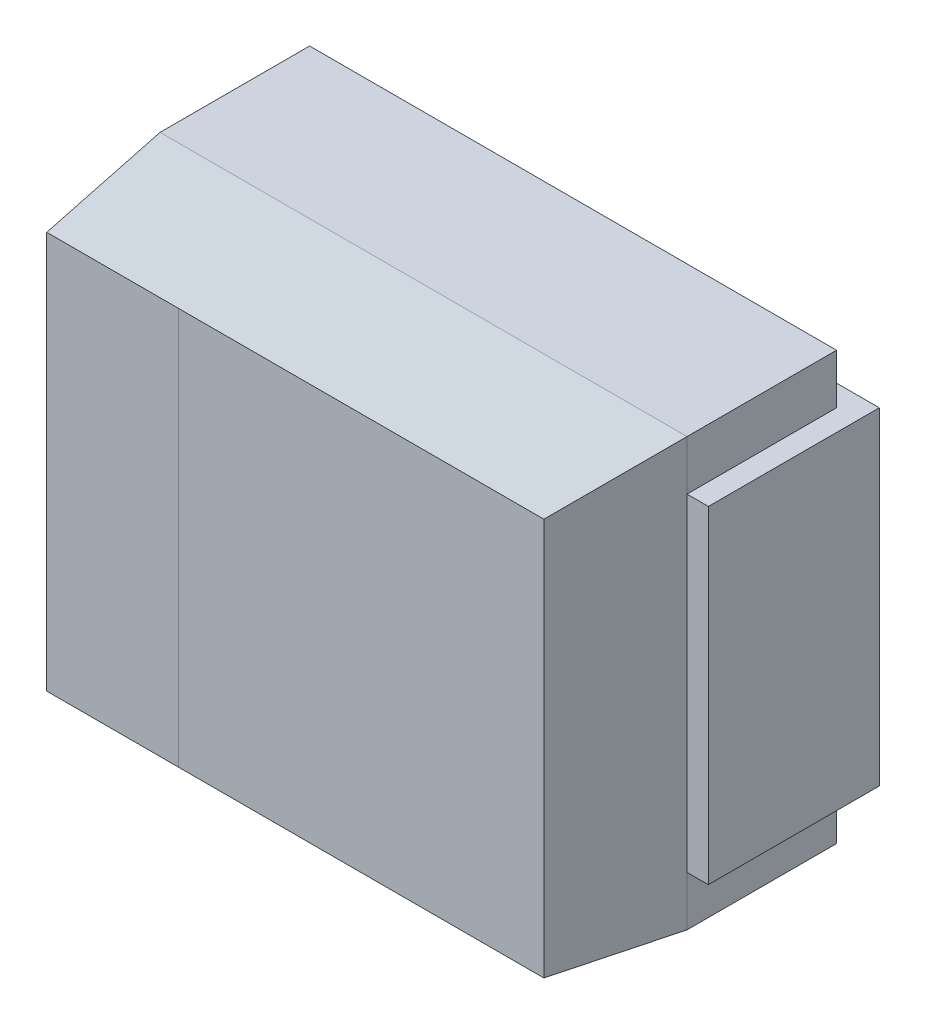
ISO-10303-21;
HEADER;
FILE_DESCRIPTION(('STEP AP214'),'2;1');
FILE_NAME('part.step','',(''),(''),'','','');
FILE_SCHEMA(('AUTOMOTIVE_DESIGN { 1 0 10303 214 1 1 1 1 }'));
ENDSEC;
DATA;
#1=APPLICATION_CONTEXT('core data for automotive mechanical design processes');
#2=APPLICATION_PROTOCOL_DEFINITION('international standard','automotive_design',2000,#1);
#3=PRODUCT_CONTEXT('',#1,'mechanical');
#4=PRODUCT('Part','Part','',(#3));
#5=PRODUCT_RELATED_PRODUCT_CATEGORY('part','',(#4));
#6=PRODUCT_DEFINITION_FORMATION('','',#4);
#7=PRODUCT_DEFINITION_CONTEXT('part definition',#1,'design');
#8=PRODUCT_DEFINITION('design','',#6,#7);
#9=PRODUCT_DEFINITION_SHAPE('','',#8);
#10=(LENGTH_UNIT() NAMED_UNIT(*) SI_UNIT(.MILLI.,.METRE.));
#11=(NAMED_UNIT(*) PLANE_ANGLE_UNIT() SI_UNIT($,.RADIAN.));
#12=(NAMED_UNIT(*) SI_UNIT($,.STERADIAN.) SOLID_ANGLE_UNIT());
#13=UNCERTAINTY_MEASURE_WITH_UNIT(LENGTH_MEASURE(1.E-05),#10,'distance_accuracy_value','');
#14=(GEOMETRIC_REPRESENTATION_CONTEXT(3) GLOBAL_UNCERTAINTY_ASSIGNED_CONTEXT((#13)) GLOBAL_UNIT_ASSIGNED_CONTEXT((#10,
#11,#12)) REPRESENTATION_CONTEXT('',''));
#15=CARTESIAN_POINT('',(0.,0.,0.));
#16=DIRECTION('',(0.,0.,1.));
#17=DIRECTION('',(1.,0.,0.));
#18=AXIS2_PLACEMENT_3D('',#15,#16,#17);
#19=CARTESIAN_POINT('',(-2.001,-1.151,0.));
#20=DIRECTION('',(0.,0.,-1.));
#21=DIRECTION('',(0.,1.,0.));
#22=AXIS2_PLACEMENT_3D('',#19,#20,#21);
#23=PLANE('',#22);
#24=DIRECTION('',(0.,1.,0.));
#25=VECTOR('',#24,1.);
#26=CARTESIAN_POINT('',(-0.9,0.,0.));
#27=LINE('',#26,#25);
#28=CARTESIAN_POINT('',(-0.9,-1.15,0.));
#29=VERTEX_POINT('',#28);
#30=CARTESIAN_POINT('',(-0.9,1.15,0.));
#31=VERTEX_POINT('',#30);
#32=EDGE_CURVE('E318',#29,#31,#27,.T.);
#33=ORIENTED_EDGE('',*,*,#32,.F.);
#34=DIRECTION('',(1.,0.,0.));
#35=VECTOR('',#34,1.);
#36=CARTESIAN_POINT('',(-1.45,-1.15,0.));
#37=LINE('',#36,#35);
#38=CARTESIAN_POINT('',(-2.,-1.15,0.));
#39=VERTEX_POINT('',#38);
#40=EDGE_CURVE('E319',#39,#29,#37,.T.);
#41=ORIENTED_EDGE('',*,*,#40,.F.);
#42=DIRECTION('',(0.,-1.,0.));
#43=VECTOR('',#42,1.);
#44=CARTESIAN_POINT('',(-2.,0.,0.));
#45=LINE('',#44,#43);
#46=CARTESIAN_POINT('',(-2.,1.15,0.));
#47=VERTEX_POINT('',#46);
#48=EDGE_CURVE('E322',#47,#39,#45,.T.);
#49=ORIENTED_EDGE('',*,*,#48,.F.);
#50=DIRECTION('',(1.,0.,0.));
#51=VECTOR('',#50,1.);
#52=CARTESIAN_POINT('',(-1.45,1.15,0.));
#53=LINE('',#52,#51);
#54=EDGE_CURVE('E325',#47,#31,#53,.T.);
#55=ORIENTED_EDGE('',*,*,#54,.T.);
#56=EDGE_LOOP('',(#33,#41,#49,#55));
#57=FACE_BOUND('',#56,.T.);
#58=ADVANCED_FACE('F16',(#57),#23,.T.);
#59=CARTESIAN_POINT('',(-2.,1.151,-0.001));
#60=DIRECTION('',(-1.,0.,0.));
#61=DIRECTION('',(0.,-1.,0.));
#62=AXIS2_PLACEMENT_3D('',#59,#60,#61);
#63=PLANE('',#62);
#64=DIRECTION('',(0.,-1.,0.));
#65=VECTOR('',#64,1.);
#66=CARTESIAN_POINT('',(-2.,0.,1.2));
#67=LINE('',#66,#65);
#68=CARTESIAN_POINT('',(-2.,1.15,1.2));
#69=VERTEX_POINT('',#68);
#70=CARTESIAN_POINT('',(-2.,-1.15,1.2));
#71=VERTEX_POINT('',#70);
#72=EDGE_CURVE('E278',#69,#71,#67,.T.);
#73=ORIENTED_EDGE('',*,*,#72,.F.);
#74=DIRECTION('',(0.,0.,1.));
#75=VECTOR('',#74,1.);
#76=CARTESIAN_POINT('',(-2.,1.15,0.6));
#77=LINE('',#76,#75);
#78=EDGE_CURVE('E304',#47,#69,#77,.T.);
#79=ORIENTED_EDGE('',*,*,#78,.F.);
#80=ORIENTED_EDGE('',*,*,#48,.T.);
#81=DIRECTION('',(0.,0.,-1.));
#82=VECTOR('',#81,1.);
#83=CARTESIAN_POINT('',(-2.,-1.15,0.6));
#84=LINE('',#83,#82);
#85=EDGE_CURVE('E315',#71,#39,#84,.T.);
#86=ORIENTED_EDGE('',*,*,#85,.F.);
#87=EDGE_LOOP('',(#73,#79,#80,#86));
#88=FACE_BOUND('',#87,.T.);
#89=ADVANCED_FACE('F613',(#88),#63,.T.);
#90=CARTESIAN_POINT('',(-2.001,-1.15,-0.001));
#91=DIRECTION('',(0.,-1.,0.));
#92=DIRECTION('',(1.,0.,0.));
#93=AXIS2_PLACEMENT_3D('',#90,#91,#92);
#94=PLANE('',#93);
#95=DIRECTION('',(1.,0.,0.));
#96=VECTOR('',#95,1.);
#97=CARTESIAN_POINT('',(-1.925,-1.15,1.2));
#98=LINE('',#97,#96);
#99=CARTESIAN_POINT('',(-1.85,-1.15,1.2));
#100=VERTEX_POINT('',#99);
#101=EDGE_CURVE('E275',#71,#100,#98,.T.);
#102=ORIENTED_EDGE('',*,*,#101,.F.);
#103=ORIENTED_EDGE('',*,*,#85,.T.);
#104=ORIENTED_EDGE('',*,*,#40,.T.);
#105=DIRECTION('',(0.,0.,-1.));
#106=VECTOR('',#105,1.);
#107=CARTESIAN_POINT('',(-0.9,-1.15,0.075));
#108=LINE('',#107,#106);
#109=CARTESIAN_POINT('',(-0.9,-1.15,0.15));
#110=VERTEX_POINT('',#109);
#111=EDGE_CURVE('E308',#110,#29,#108,.T.);
#112=ORIENTED_EDGE('',*,*,#111,.F.);
#113=DIRECTION('',(1.,0.,0.));
#114=VECTOR('',#113,1.);
#115=CARTESIAN_POINT('',(0.,-1.15,0.15));
#116=LINE('',#115,#114);
#117=CARTESIAN_POINT('',(-1.85,-1.15,0.15));
#118=VERTEX_POINT('',#117);
#119=EDGE_CURVE('E228',#118,#110,#116,.T.);
#120=ORIENTED_EDGE('',*,*,#119,.F.);
#121=DIRECTION('',(0.,0.,-1.));
#122=VECTOR('',#121,1.);
#123=CARTESIAN_POINT('',(-1.85,-1.15,0.675));
#124=LINE('',#123,#122);
#125=EDGE_CURVE('E266',#100,#118,#124,.T.);
#126=ORIENTED_EDGE('',*,*,#125,.F.);
#127=EDGE_LOOP('',(#102,#103,#104,#112,#120,#126));
#128=FACE_BOUND('',#127,.T.);
#129=ADVANCED_FACE('F564',(#128),#94,.T.);
#130=CARTESIAN_POINT('',(-0.9,-1.151,-0.001));
#131=DIRECTION('',(1.,0.,0.));
#132=DIRECTION('',(0.,1.,0.));
#133=AXIS2_PLACEMENT_3D('',#130,#131,#132);
#134=PLANE('',#133);
#135=DIRECTION('',(0.,1.,0.));
#136=VECTOR('',#135,1.);
#137=CARTESIAN_POINT('',(-0.9,0.,0.15));
#138=LINE('',#137,#136);
#139=CARTESIAN_POINT('',(-0.9,1.15,0.15));
#140=VERTEX_POINT('',#139);
#141=EDGE_CURVE('E224',#110,#140,#138,.T.);
#142=ORIENTED_EDGE('',*,*,#141,.F.);
#143=ORIENTED_EDGE('',*,*,#111,.T.);
#144=ORIENTED_EDGE('',*,*,#32,.T.);
#145=DIRECTION('',(0.,0.,-1.));
#146=VECTOR('',#145,1.);
#147=CARTESIAN_POINT('',(-0.9,1.15,0.6));
#148=LINE('',#147,#146);
#149=EDGE_CURVE('E307',#140,#31,#148,.T.);
#150=ORIENTED_EDGE('',*,*,#149,.F.);
#151=EDGE_LOOP('',(#142,#143,#144,#150));
#152=FACE_BOUND('',#151,.T.);
#153=ADVANCED_FACE('F616',(#152),#134,.T.);
#154=CARTESIAN_POINT('',(-0.899,1.15,-0.001));
#155=DIRECTION('',(0.,1.,0.));
#156=DIRECTION('',(-1.,0.,0.));
#157=AXIS2_PLACEMENT_3D('',#154,#155,#156);
#158=PLANE('',#157);
#159=DIRECTION('',(-1.,0.,0.));
#160=VECTOR('',#159,1.);
#161=CARTESIAN_POINT('',(0.,1.15,0.15));
#162=LINE('',#161,#160);
#163=CARTESIAN_POINT('',(-1.85,1.15,0.15));
#164=VERTEX_POINT('',#163);
#165=EDGE_CURVE('E227',#140,#164,#162,.T.);
#166=ORIENTED_EDGE('',*,*,#165,.F.);
#167=ORIENTED_EDGE('',*,*,#149,.T.);
#168=ORIENTED_EDGE('',*,*,#54,.F.);
#169=ORIENTED_EDGE('',*,*,#78,.T.);
#170=DIRECTION('',(-1.,0.,0.));
#171=VECTOR('',#170,1.);
#172=CARTESIAN_POINT('',(-1.925,1.15,1.2));
#173=LINE('',#172,#171);
#174=CARTESIAN_POINT('',(-1.85,1.15,1.2));
#175=VERTEX_POINT('',#174);
#176=EDGE_CURVE('E268',#175,#69,#173,.T.);
#177=ORIENTED_EDGE('',*,*,#176,.F.);
#178=DIRECTION('',(0.,0.,1.));
#179=VECTOR('',#178,1.);
#180=CARTESIAN_POINT('',(-1.85,1.15,0.675));
#181=LINE('',#180,#179);
#182=EDGE_CURVE('E237',#164,#175,#181,.T.);
#183=ORIENTED_EDGE('',*,*,#182,.F.);
#184=EDGE_LOOP('',(#166,#167,#168,#169,#177,#183));
#185=FACE_BOUND('',#184,.T.);
#186=ADVANCED_FACE('F609',(#185),#158,.T.);
#187=CARTESIAN_POINT('',(-2.001,1.151,1.2));
#188=DIRECTION('',(0.,0.,1.));
#189=DIRECTION('',(0.,-1.,0.));
#190=AXIS2_PLACEMENT_3D('',#187,#188,#189);
#191=PLANE('',#190);
#192=DIRECTION('',(0.,-1.,0.));
#193=VECTOR('',#192,1.);
#194=CARTESIAN_POINT('',(-1.85,0.,1.2));
#195=LINE('',#194,#193);
#196=EDGE_CURVE('E248',#175,#100,#195,.T.);
#197=ORIENTED_EDGE('',*,*,#196,.F.);
#198=ORIENTED_EDGE('',*,*,#176,.T.);
#199=ORIENTED_EDGE('',*,*,#72,.T.);
#200=ORIENTED_EDGE('',*,*,#101,.T.);
#201=EDGE_LOOP('',(#197,#198,#199,#200));
#202=FACE_BOUND('',#201,.T.);
#203=ADVANCED_FACE('F561',(#202),#191,.T.);
#204=CARTESIAN_POINT('',(-1.85,-1.149,1.201));
#205=DIRECTION('',(-1.,0.,0.));
#206=DIRECTION('',(0.,0.,-1.));
#207=AXIS2_PLACEMENT_3D('',#204,#205,#206);
#208=PLANE('',#207);
#209=DIRECTION('',(0.,0.,-1.));
#210=VECTOR('',#209,1.);
#211=CARTESIAN_POINT('',(-1.85,-1.5,0.675));
#212=LINE('',#211,#210);
#213=CARTESIAN_POINT('',(-1.85,-1.5,1.2));
#214=VERTEX_POINT('',#213);
#215=CARTESIAN_POINT('',(-1.85,-1.5,0.15));
#216=VERTEX_POINT('',#215);
#217=EDGE_CURVE('E218',#214,#216,#212,.T.);
#218=ORIENTED_EDGE('',*,*,#217,.F.);
#219=DIRECTION('',(0.,-1.,0.));
#220=VECTOR('',#219,1.);
#221=CARTESIAN_POINT('',(-1.85,0.,1.2));
#222=LINE('',#221,#220);
#223=EDGE_CURVE('E260',#100,#214,#222,.T.);
#224=ORIENTED_EDGE('',*,*,#223,.F.);
#225=ORIENTED_EDGE('',*,*,#125,.T.);
#226=DIRECTION('',(0.,1.,0.));
#227=VECTOR('',#226,1.);
#228=CARTESIAN_POINT('',(-1.85,0.,0.15));
#229=LINE('',#228,#227);
#230=EDGE_CURVE('E231',#216,#118,#229,.T.);
#231=ORIENTED_EDGE('',*,*,#230,.F.);
#232=EDGE_LOOP('',(#218,#224,#225,#231));
#233=FACE_BOUND('',#232,.T.);
#234=ADVANCED_FACE('F557',(#233),#208,.T.);
#235=CARTESIAN_POINT('',(-1.85,1.501,1.201));
#236=DIRECTION('',(-1.,0.,0.));
#237=DIRECTION('',(0.,0.,-1.));
#238=AXIS2_PLACEMENT_3D('',#235,#236,#237);
#239=PLANE('',#238);
#240=DIRECTION('',(0.,0.,1.));
#241=VECTOR('',#240,1.);
#242=CARTESIAN_POINT('',(-1.85,1.5,0.675));
#243=LINE('',#242,#241);
#244=CARTESIAN_POINT('',(-1.85,1.5,0.15));
#245=VERTEX_POINT('',#244);
#246=CARTESIAN_POINT('',(-1.85,1.5,1.2));
#247=VERTEX_POINT('',#246);
#248=EDGE_CURVE('E209',#245,#247,#243,.T.);
#249=ORIENTED_EDGE('',*,*,#248,.F.);
#250=DIRECTION('',(0.,1.,0.));
#251=VECTOR('',#250,1.);
#252=CARTESIAN_POINT('',(-1.85,0.,0.15));
#253=LINE('',#252,#251);
#254=EDGE_CURVE('E223',#164,#245,#253,.T.);
#255=ORIENTED_EDGE('',*,*,#254,.F.);
#256=ORIENTED_EDGE('',*,*,#182,.T.);
#257=DIRECTION('',(0.,-1.,0.));
#258=VECTOR('',#257,1.);
#259=CARTESIAN_POINT('',(-1.85,0.,1.2));
#260=LINE('',#259,#258);
#261=EDGE_CURVE('E222',#247,#175,#260,.T.);
#262=ORIENTED_EDGE('',*,*,#261,.F.);
#263=EDGE_LOOP('',(#249,#255,#256,#262));
#264=FACE_BOUND('',#263,.T.);
#265=ADVANCED_FACE('F606',(#264),#239,.T.);
#266=CARTESIAN_POINT('',(-1.851,-1.501,0.15));
#267=DIRECTION('',(0.,0.,-1.));
#268=DIRECTION('',(0.,1.,0.));
#269=AXIS2_PLACEMENT_3D('',#266,#267,#268);
#270=PLANE('',#269);
#271=DIRECTION('',(-1.,0.,0.));
#272=VECTOR('',#271,1.);
#273=CARTESIAN_POINT('',(0.,1.5,0.15));
#274=LINE('',#273,#272);
#275=CARTESIAN_POINT('',(1.85,1.5,0.15));
#276=VERTEX_POINT('',#275);
#277=EDGE_CURVE('E210',#276,#245,#274,.T.);
#278=ORIENTED_EDGE('',*,*,#277,.F.);
#279=DIRECTION('',(0.,-1.,0.));
#280=VECTOR('',#279,1.);
#281=CARTESIAN_POINT('',(1.85,0.,0.15));
#282=LINE('',#281,#280);
#283=CARTESIAN_POINT('',(1.85,1.15,0.15));
#284=VERTEX_POINT('',#283);
#285=EDGE_CURVE('E219',#276,#284,#282,.T.);
#286=ORIENTED_EDGE('',*,*,#285,.T.);
#287=DIRECTION('',(-1.,0.,0.));
#288=VECTOR('',#287,1.);
#289=CARTESIAN_POINT('',(0.,1.15,0.15));
#290=LINE('',#289,#288);
#291=CARTESIAN_POINT('',(0.9,1.15,0.15));
#292=VERTEX_POINT('',#291);
#293=EDGE_CURVE('E235',#284,#292,#290,.T.);
#294=ORIENTED_EDGE('',*,*,#293,.T.);
#295=DIRECTION('',(0.,1.,0.));
#296=VECTOR('',#295,1.);
#297=CARTESIAN_POINT('',(0.9,0.,0.15));
#298=LINE('',#297,#296);
#299=CARTESIAN_POINT('',(0.9,-1.15,0.15));
#300=VERTEX_POINT('',#299);
#301=EDGE_CURVE('E203',#300,#292,#298,.T.);
#302=ORIENTED_EDGE('',*,*,#301,.F.);
#303=DIRECTION('',(1.,0.,0.));
#304=VECTOR('',#303,1.);
#305=CARTESIAN_POINT('',(0.,-1.15,0.15));
#306=LINE('',#305,#304);
#307=CARTESIAN_POINT('',(1.85,-1.15,0.15));
#308=VERTEX_POINT('',#307);
#309=EDGE_CURVE('E232',#300,#308,#306,.T.);
#310=ORIENTED_EDGE('',*,*,#309,.T.);
#311=DIRECTION('',(0.,-1.,0.));
#312=VECTOR('',#311,1.);
#313=CARTESIAN_POINT('',(1.85,0.,0.15));
#314=LINE('',#313,#312);
#315=CARTESIAN_POINT('',(1.85,-1.5,0.15));
#316=VERTEX_POINT('',#315);
#317=EDGE_CURVE('E229',#308,#316,#314,.T.);
#318=ORIENTED_EDGE('',*,*,#317,.T.);
#319=DIRECTION('',(1.,0.,0.));
#320=VECTOR('',#319,1.);
#321=CARTESIAN_POINT('',(0.,-1.5,0.15));
#322=LINE('',#321,#320);
#323=EDGE_CURVE('E214',#216,#316,#322,.T.);
#324=ORIENTED_EDGE('',*,*,#323,.F.);
#325=ORIENTED_EDGE('',*,*,#230,.T.);
#326=ORIENTED_EDGE('',*,*,#119,.T.);
#327=ORIENTED_EDGE('',*,*,#141,.T.);
#328=ORIENTED_EDGE('',*,*,#165,.T.);
#329=ORIENTED_EDGE('',*,*,#254,.T.);
#330=EDGE_LOOP('',(#278,#286,#294,#302,#310,#318,#324,#325,#326,#327,#328,#329));
#331=FACE_BOUND('',#330,.T.);
#332=ADVANCED_FACE('F365',(#331),#270,.T.);
#333=CARTESIAN_POINT('',(-1.74488411930044,1.501,2.10099326313909));
#334=DIRECTION('',(-0.993263139087243,0.,0.115880699560177));
#335=DIRECTION('',(-0.115880699560177,0.,-0.993263139087243));
#336=AXIS2_PLACEMENT_3D('',#333,#334,#335);
#337=PLANE('',#336);
#338=CARTESIAN_POINT('',(-1.74476979994519,1.395,2.102));
#339=DIRECTION('',(0.,-1.,0.));
#340=VECTOR('',#339,1.);
#341=LINE('',#338,#340);
#342=CARTESIAN_POINT('',(-1.7449616333242,1.395,2.10099552388782));
#343=VERTEX_POINT('',#342);
#344=CARTESIAN_POINT('',(-1.7449232666484,-1.395,2.10099552388782));
#345=VERTEX_POINT('',#344);
#346=EDGE_CURVE('E202',#343,#345,#341,.T.);
#347=ORIENTED_EDGE('',*,*,#346,.F.);
#348=CARTESIAN_POINT('',(-1.745,1.395,2.1));
#349=DIRECTION('',(-0.115110406239669,0.11511040623967,-0.986660624911462));
#350=VECTOR('',#349,1.);
#351=LINE('',#348,#350);
#352=EDGE_CURVE('E176',#343,#247,#351,.T.);
#353=ORIENTED_EDGE('',*,*,#352,.T.);
#354=ORIENTED_EDGE('',*,*,#261,.T.);
#355=ORIENTED_EDGE('',*,*,#196,.T.);
#356=ORIENTED_EDGE('',*,*,#223,.T.);
#357=CARTESIAN_POINT('',(-1.85,-1.5,1.2));
#358=DIRECTION('',(0.115110406239669,0.115110406239671,0.986660624911462));
#359=VECTOR('',#358,1.);
#360=LINE('',#357,#359);
#361=EDGE_CURVE('E263',#214,#345,#360,.T.);
#362=ORIENTED_EDGE('',*,*,#361,.T.);
#363=EDGE_LOOP('',(#347,#353,#354,#355,#356,#362));
#364=FACE_BOUND('',#363,.T.);
#365=ADVANCED_FACE('F354',(#364),#337,.T.);
#366=CARTESIAN_POINT('',(-1.851,-1.5,1.201));
#367=DIRECTION('',(0.,-1.,0.));
#368=DIRECTION('',(0.,0.,-1.));
#369=AXIS2_PLACEMENT_3D('',#366,#367,#368);
#370=PLANE('',#369);
#371=ORIENTED_EDGE('',*,*,#323,.T.);
#372=DIRECTION('',(0.,0.,1.));
#373=VECTOR('',#372,1.);
#374=CARTESIAN_POINT('',(1.85,-1.5,0.675));
#375=LINE('',#374,#373);
#376=CARTESIAN_POINT('',(1.85,-1.5,1.2));
#377=VERTEX_POINT('',#376);
#378=EDGE_CURVE('E217',#316,#377,#375,.T.);
#379=ORIENTED_EDGE('',*,*,#378,.T.);
#380=DIRECTION('',(1.,0.,0.));
#381=VECTOR('',#380,1.);
#382=CARTESIAN_POINT('',(0.,-1.5,1.2));
#383=LINE('',#382,#381);
#384=EDGE_CURVE('E251',#214,#377,#383,.T.);
#385=ORIENTED_EDGE('',*,*,#384,.F.);
#386=ORIENTED_EDGE('',*,*,#217,.T.);
#387=EDGE_LOOP('',(#371,#379,#385,#386));
#388=FACE_BOUND('',#387,.T.);
#389=ADVANCED_FACE('F364',(#388),#370,.T.);
#390=CARTESIAN_POINT('',(-1.851,1.5,0.149));
#391=DIRECTION('',(0.,1.,0.));
#392=DIRECTION('',(0.,0.,1.));
#393=AXIS2_PLACEMENT_3D('',#390,#391,#392);
#394=PLANE('',#393);
#395=ORIENTED_EDGE('',*,*,#277,.T.);
#396=ORIENTED_EDGE('',*,*,#248,.T.);
#397=DIRECTION('',(-1.,0.,0.));
#398=VECTOR('',#397,1.);
#399=CARTESIAN_POINT('',(0.,1.5,1.2));
#400=LINE('',#399,#398);
#401=CARTESIAN_POINT('',(1.85,1.5,1.2));
#402=VERTEX_POINT('',#401);
#403=EDGE_CURVE('E238',#402,#247,#400,.T.);
#404=ORIENTED_EDGE('',*,*,#403,.F.);
#405=DIRECTION('',(0.,0.,-1.));
#406=VECTOR('',#405,1.);
#407=CARTESIAN_POINT('',(1.85,1.5,0.675));
#408=LINE('',#407,#406);
#409=EDGE_CURVE('E213',#402,#276,#408,.T.);
#410=ORIENTED_EDGE('',*,*,#409,.T.);
#411=EDGE_LOOP('',(#395,#396,#404,#410));
#412=FACE_BOUND('',#411,.T.);
#413=ADVANCED_FACE('F602',(#412),#394,.T.);
#414=CARTESIAN_POINT('',(0.9,1.151,-0.001));
#415=DIRECTION('',(-1.,0.,0.));
#416=DIRECTION('',(0.,-1.,0.));
#417=AXIS2_PLACEMENT_3D('',#414,#415,#416);
#418=PLANE('',#417);
#419=ORIENTED_EDGE('',*,*,#301,.T.);
#420=DIRECTION('',(0.,0.,-1.));
#421=VECTOR('',#420,1.);
#422=CARTESIAN_POINT('',(0.9,1.15,0.075));
#423=LINE('',#422,#421);
#424=CARTESIAN_POINT('',(0.9,1.15,0.));
#425=VERTEX_POINT('',#424);
#426=EDGE_CURVE('E200',#292,#425,#423,.T.);
#427=ORIENTED_EDGE('',*,*,#426,.T.);
#428=DIRECTION('',(0.,1.,0.));
#429=VECTOR('',#428,1.);
#430=CARTESIAN_POINT('',(0.9,0.,0.));
#431=LINE('',#430,#429);
#432=CARTESIAN_POINT('',(0.9,-1.15,0.));
#433=VERTEX_POINT('',#432);
#434=EDGE_CURVE('E585',#433,#425,#431,.T.);
#435=ORIENTED_EDGE('',*,*,#434,.F.);
#436=DIRECTION('',(0.,0.,1.));
#437=VECTOR('',#436,1.);
#438=CARTESIAN_POINT('',(0.9,-1.15,0.075));
#439=LINE('',#438,#437);
#440=EDGE_CURVE('E206',#433,#300,#439,.T.);
#441=ORIENTED_EDGE('',*,*,#440,.T.);
#442=EDGE_LOOP('',(#419,#427,#435,#441));
#443=FACE_BOUND('',#442,.T.);
#444=ADVANCED_FACE('F402',(#443),#418,.T.);
#445=CARTESIAN_POINT('',(-1.746,1.396,2.102));
#446=DIRECTION('',(0.,0.,1.));
#447=DIRECTION('',(0.,-1.,0.));
#448=AXIS2_PLACEMENT_3D('',#445,#446,#447);
#449=PLANE('',#448);
#450=CARTESIAN_POINT('',(-1.745,1.39476979994519,2.10197314332694));
#451=DIRECTION('',(1.,0.,0.));
#452=VECTOR('',#451,1.);
#453=LINE('',#450,#452);
#454=CARTESIAN_POINT('',(-0.82,1.395,2.1008));
#455=VERTEX_POINT('',#454);
#456=EDGE_CURVE('E157',#343,#455,#453,.T.);
#457=ORIENTED_EDGE('',*,*,#456,.F.);
#458=ORIENTED_EDGE('',*,*,#346,.T.);
#459=CARTESIAN_POINT('',(-0.82,-1.39476979994519,2.10197314332694));
#460=DIRECTION('',(-1.,0.,0.));
#461=VECTOR('',#460,1.);
#462=LINE('',#459,#461);
#463=CARTESIAN_POINT('',(-0.82,-1.395,2.1008));
#464=VERTEX_POINT('',#463);
#465=EDGE_CURVE('E148',#464,#345,#462,.T.);
#466=ORIENTED_EDGE('',*,*,#465,.F.);
#467=CARTESIAN_POINT('',(-0.82,1.395,2.1));
#468=DIRECTION('',(0.,-1.,0.));
#469=VECTOR('',#468,1.);
#470=LINE('',#467,#469);
#471=EDGE_CURVE('E153',#455,#464,#470,.T.);
#472=ORIENTED_EDGE('',*,*,#471,.F.);
#473=EDGE_LOOP('',(#457,#458,#466,#472));
#474=FACE_BOUND('',#473,.T.);
#475=ADVANCED_FACE('F156',(#474),#449,.T.);
#476=CARTESIAN_POINT('',(-1.851,-1.39488411930044,2.10099326313909));
#477=DIRECTION('',(0.,-0.993263139087243,0.115880699560177));
#478=DIRECTION('',(0.,-0.115880699560177,-0.993263139087243));
#479=AXIS2_PLACEMENT_3D('',#476,#477,#478);
#480=PLANE('',#479);
#481=ORIENTED_EDGE('',*,*,#384,.T.);
#482=CARTESIAN_POINT('',(1.85,-1.5,1.2));
#483=DIRECTION('',(-0.11511040623967,0.115110406239669,0.986660624911462));
#484=VECTOR('',#483,1.);
#485=LINE('',#482,#484);
#486=CARTESIAN_POINT('',(1.745,-1.395,2.1));
#487=VERTEX_POINT('',#486);
#488=EDGE_CURVE('E180',#377,#487,#485,.T.);
#489=ORIENTED_EDGE('',*,*,#488,.T.);
#490=DIRECTION('',(1.,0.,0.));
#491=VECTOR('',#490,1.);
#492=CARTESIAN_POINT('',(0.4625,-1.395,2.1));
#493=LINE('',#492,#491);
#494=EDGE_CURVE('E163',#464,#487,#493,.T.);
#495=ORIENTED_EDGE('',*,*,#494,.F.);
#496=ORIENTED_EDGE('',*,*,#465,.T.);
#497=ORIENTED_EDGE('',*,*,#361,.F.);
#498=EDGE_LOOP('',(#481,#489,#495,#496,#497));
#499=FACE_BOUND('',#498,.T.);
#500=ADVANCED_FACE('F401',(#499),#480,.T.);
#501=CARTESIAN_POINT('',(-1.851,1.50011588069956,1.19900673686091));
#502=DIRECTION('',(0.,0.993263139087243,0.115880699560177));
#503=DIRECTION('',(0.,-0.115880699560177,0.993263139087243));
#504=AXIS2_PLACEMENT_3D('',#501,#502,#503);
#505=PLANE('',#504);
#506=ORIENTED_EDGE('',*,*,#403,.T.);
#507=ORIENTED_EDGE('',*,*,#352,.F.);
#508=ORIENTED_EDGE('',*,*,#456,.T.);
#509=DIRECTION('',(-1.,0.,0.));
#510=VECTOR('',#509,1.);
#511=CARTESIAN_POINT('',(0.4625,1.395,2.1));
#512=LINE('',#511,#510);
#513=CARTESIAN_POINT('',(1.745,1.395,2.1));
#514=VERTEX_POINT('',#513);
#515=EDGE_CURVE('E173',#514,#455,#512,.T.);
#516=ORIENTED_EDGE('',*,*,#515,.F.);
#517=CARTESIAN_POINT('',(1.745,1.395,2.1));
#518=DIRECTION('',(0.11511040623967,0.115110406239669,-0.986660624911462));
#519=VECTOR('',#518,1.);
#520=LINE('',#517,#519);
#521=EDGE_CURVE('E179',#514,#402,#520,.T.);
#522=ORIENTED_EDGE('',*,*,#521,.T.);
#523=EDGE_LOOP('',(#506,#507,#508,#516,#522));
#524=FACE_BOUND('',#523,.T.);
#525=ADVANCED_FACE('F171',(#524),#505,.T.);
#526=CARTESIAN_POINT('',(0.899,-1.151,0.));
#527=DIRECTION('',(0.,0.,-1.));
#528=DIRECTION('',(0.,1.,0.));
#529=AXIS2_PLACEMENT_3D('',#526,#527,#528);
#530=PLANE('',#529);
#531=ORIENTED_EDGE('',*,*,#434,.T.);
#532=DIRECTION('',(1.,0.,0.));
#533=VECTOR('',#532,1.);
#534=CARTESIAN_POINT('',(1.45,1.15,0.));
#535=LINE('',#534,#533);
#536=CARTESIAN_POINT('',(2.,1.15,0.));
#537=VERTEX_POINT('',#536);
#538=EDGE_CURVE('E164',#425,#537,#535,.T.);
#539=ORIENTED_EDGE('',*,*,#538,.T.);
#540=DIRECTION('',(0.,1.,0.));
#541=VECTOR('',#540,1.);
#542=CARTESIAN_POINT('',(2.,0.,0.));
#543=LINE('',#542,#541);
#544=CARTESIAN_POINT('',(2.,-1.15,0.));
#545=VERTEX_POINT('',#544);
#546=EDGE_CURVE('E186',#545,#537,#543,.T.);
#547=ORIENTED_EDGE('',*,*,#546,.F.);
#548=DIRECTION('',(-1.,0.,0.));
#549=VECTOR('',#548,1.);
#550=CARTESIAN_POINT('',(1.45,-1.15,0.));
#551=LINE('',#550,#549);
#552=EDGE_CURVE('E194',#545,#433,#551,.T.);
#553=ORIENTED_EDGE('',*,*,#552,.T.);
#554=EDGE_LOOP('',(#531,#539,#547,#553));
#555=FACE_BOUND('',#554,.T.);
#556=ADVANCED_FACE('F481',(#555),#530,.T.);
#557=CARTESIAN_POINT('',(-0.821,1.396,2.1));
#558=DIRECTION('',(0.,0.,1.));
#559=DIRECTION('',(0.,-1.,0.));
#560=AXIS2_PLACEMENT_3D('',#557,#558,#559);
#561=PLANE('',#560);
#562=DIRECTION('',(0.,-1.,0.));
#563=VECTOR('',#562,1.);
#564=CARTESIAN_POINT('',(1.745,0.,2.1));
#565=LINE('',#564,#563);
#566=EDGE_CURVE('E185',#514,#487,#565,.T.);
#567=ORIENTED_EDGE('',*,*,#566,.F.);
#568=ORIENTED_EDGE('',*,*,#515,.T.);
#569=ORIENTED_EDGE('',*,*,#471,.T.);
#570=ORIENTED_EDGE('',*,*,#494,.T.);
#571=EDGE_LOOP('',(#567,#568,#569,#570));
#572=FACE_BOUND('',#571,.T.);
#573=ADVANCED_FACE('F183',(#572),#561,.T.);
#574=CARTESIAN_POINT('',(1.85,1.501,0.149));
#575=DIRECTION('',(1.,0.,0.));
#576=DIRECTION('',(0.,0.,1.));
#577=AXIS2_PLACEMENT_3D('',#574,#575,#576);
#578=PLANE('',#577);
#579=ORIENTED_EDGE('',*,*,#409,.F.);
#580=DIRECTION('',(0.,1.,0.));
#581=VECTOR('',#580,1.);
#582=CARTESIAN_POINT('',(1.85,0.,1.2));
#583=LINE('',#582,#581);
#584=CARTESIAN_POINT('',(1.85,1.15,1.2));
#585=VERTEX_POINT('',#584);
#586=EDGE_CURVE('E465',#585,#402,#583,.T.);
#587=ORIENTED_EDGE('',*,*,#586,.F.);
#588=DIRECTION('',(0.,0.,1.));
#589=VECTOR('',#588,1.);
#590=CARTESIAN_POINT('',(1.85,1.15,0.6));
#591=LINE('',#590,#589);
#592=EDGE_CURVE('E189',#284,#585,#591,.T.);
#593=ORIENTED_EDGE('',*,*,#592,.F.);
#594=ORIENTED_EDGE('',*,*,#285,.F.);
#595=EDGE_LOOP('',(#579,#587,#593,#594));
#596=FACE_BOUND('',#595,.T.);
#597=ADVANCED_FACE('F523',(#596),#578,.T.);
#598=CARTESIAN_POINT('',(1.85,-1.149,0.149));
#599=DIRECTION('',(1.,0.,0.));
#600=DIRECTION('',(0.,0.,1.));
#601=AXIS2_PLACEMENT_3D('',#598,#599,#600);
#602=PLANE('',#601);
#603=ORIENTED_EDGE('',*,*,#378,.F.);
#604=ORIENTED_EDGE('',*,*,#317,.F.);
#605=DIRECTION('',(0.,0.,-1.));
#606=VECTOR('',#605,1.);
#607=CARTESIAN_POINT('',(1.85,-1.15,0.6));
#608=LINE('',#607,#606);
#609=CARTESIAN_POINT('',(1.85,-1.15,1.2));
#610=VERTEX_POINT('',#609);
#611=EDGE_CURVE('E37',#610,#308,#608,.T.);
#612=ORIENTED_EDGE('',*,*,#611,.F.);
#613=DIRECTION('',(0.,1.,0.));
#614=VECTOR('',#613,1.);
#615=CARTESIAN_POINT('',(1.85,0.,1.2));
#616=LINE('',#615,#614);
#617=EDGE_CURVE('E463',#377,#610,#616,.T.);
#618=ORIENTED_EDGE('',*,*,#617,.F.);
#619=EDGE_LOOP('',(#603,#604,#612,#618));
#620=FACE_BOUND('',#619,.T.);
#621=ADVANCED_FACE('F526',(#620),#602,.T.);
#622=CARTESIAN_POINT('',(2.,-1.151,-0.001));
#623=DIRECTION('',(1.,0.,0.));
#624=DIRECTION('',(0.,1.,0.));
#625=AXIS2_PLACEMENT_3D('',#622,#623,#624);
#626=PLANE('',#625);
#627=DIRECTION('',(0.,1.,0.));
#628=VECTOR('',#627,1.);
#629=CARTESIAN_POINT('',(2.,0.,1.2));
#630=LINE('',#629,#628);
#631=CARTESIAN_POINT('',(2.,-1.15,1.2));
#632=VERTEX_POINT('',#631);
#633=CARTESIAN_POINT('',(2.,1.15,1.2));
#634=VERTEX_POINT('',#633);
#635=EDGE_CURVE('E573',#632,#634,#630,.T.);
#636=ORIENTED_EDGE('',*,*,#635,.F.);
#637=DIRECTION('',(0.,0.,1.));
#638=VECTOR('',#637,1.);
#639=CARTESIAN_POINT('',(2.,-1.15,0.6));
#640=LINE('',#639,#638);
#641=EDGE_CURVE('E508',#545,#632,#640,.T.);
#642=ORIENTED_EDGE('',*,*,#641,.F.);
#643=ORIENTED_EDGE('',*,*,#546,.T.);
#644=DIRECTION('',(0.,0.,-1.));
#645=VECTOR('',#644,1.);
#646=CARTESIAN_POINT('',(2.,1.15,0.6));
#647=LINE('',#646,#645);
#648=EDGE_CURVE('E469',#634,#537,#647,.T.);
#649=ORIENTED_EDGE('',*,*,#648,.F.);
#650=EDGE_LOOP('',(#636,#642,#643,#649));
#651=FACE_BOUND('',#650,.T.);
#652=ADVANCED_FACE('F530',(#651),#626,.T.);
#653=CARTESIAN_POINT('',(2.001,1.15,-0.001));
#654=DIRECTION('',(0.,1.,0.));
#655=DIRECTION('',(-1.,0.,0.));
#656=AXIS2_PLACEMENT_3D('',#653,#654,#655);
#657=PLANE('',#656);
#658=DIRECTION('',(-1.,0.,0.));
#659=VECTOR('',#658,1.);
#660=CARTESIAN_POINT('',(1.925,1.15,1.2));
#661=LINE('',#660,#659);
#662=EDGE_CURVE('E576',#634,#585,#661,.T.);
#663=ORIENTED_EDGE('',*,*,#662,.F.);
#664=ORIENTED_EDGE('',*,*,#648,.T.);
#665=ORIENTED_EDGE('',*,*,#538,.F.);
#666=ORIENTED_EDGE('',*,*,#426,.F.);
#667=ORIENTED_EDGE('',*,*,#293,.F.);
#668=ORIENTED_EDGE('',*,*,#592,.T.);
#669=EDGE_LOOP('',(#663,#664,#665,#666,#667,#668));
#670=FACE_BOUND('',#669,.T.);
#671=ADVANCED_FACE('F533',(#670),#657,.T.);
#672=CARTESIAN_POINT('',(1.85011588069956,1.501,1.19900673686091));
#673=DIRECTION('',(0.993263139087243,0.,0.115880699560177));
#674=DIRECTION('',(-0.115880699560177,0.,0.993263139087243));
#675=AXIS2_PLACEMENT_3D('',#672,#673,#674);
#676=PLANE('',#675);
#677=ORIENTED_EDGE('',*,*,#586,.T.);
#678=ORIENTED_EDGE('',*,*,#521,.F.);
#679=ORIENTED_EDGE('',*,*,#566,.T.);
#680=ORIENTED_EDGE('',*,*,#488,.F.);
#681=ORIENTED_EDGE('',*,*,#617,.T.);
#682=DIRECTION('',(0.,-1.,0.));
#683=VECTOR('',#682,1.);
#684=CARTESIAN_POINT('',(1.85,0.,1.2));
#685=LINE('',#684,#683);
#686=EDGE_CURVE('E28',#585,#610,#685,.T.);
#687=ORIENTED_EDGE('',*,*,#686,.F.);
#688=EDGE_LOOP('',(#677,#678,#679,#680,#681,#687));
#689=FACE_BOUND('',#688,.T.);
#690=ADVANCED_FACE('F536',(#689),#676,.T.);
#691=CARTESIAN_POINT('',(0.899,-1.15,-0.001));
#692=DIRECTION('',(0.,-1.,0.));
#693=DIRECTION('',(1.,0.,0.));
#694=AXIS2_PLACEMENT_3D('',#691,#692,#693);
#695=PLANE('',#694);
#696=ORIENTED_EDGE('',*,*,#309,.F.);
#697=ORIENTED_EDGE('',*,*,#440,.F.);
#698=ORIENTED_EDGE('',*,*,#552,.F.);
#699=ORIENTED_EDGE('',*,*,#641,.T.);
#700=DIRECTION('',(1.,0.,0.));
#701=VECTOR('',#700,1.);
#702=CARTESIAN_POINT('',(1.925,-1.15,1.2));
#703=LINE('',#702,#701);
#704=EDGE_CURVE('E11',#610,#632,#703,.T.);
#705=ORIENTED_EDGE('',*,*,#704,.F.);
#706=ORIENTED_EDGE('',*,*,#611,.T.);
#707=EDGE_LOOP('',(#696,#697,#698,#699,#705,#706));
#708=FACE_BOUND('',#707,.T.);
#709=ADVANCED_FACE('F540',(#708),#695,.T.);
#710=CARTESIAN_POINT('',(1.849,1.151,1.2));
#711=DIRECTION('',(0.,0.,1.));
#712=DIRECTION('',(0.,-1.,0.));
#713=AXIS2_PLACEMENT_3D('',#710,#711,#712);
#714=PLANE('',#713);
#715=ORIENTED_EDGE('',*,*,#686,.T.);
#716=ORIENTED_EDGE('',*,*,#704,.T.);
#717=ORIENTED_EDGE('',*,*,#635,.T.);
#718=ORIENTED_EDGE('',*,*,#662,.T.);
#719=EDGE_LOOP('',(#715,#716,#717,#718));
#720=FACE_BOUND('',#719,.T.);
#721=ADVANCED_FACE('F18',(#720),#714,.T.);
#722=CLOSED_SHELL('',(#58,#89,#129,#153,#186,#203,#234,#265,#332,#365,#389,#413,#444,#475,#500,
#525,#556,#573,#597,#621,#652,#671,#690,#709,#721));
#723=MANIFOLD_SOLID_BREP('B1',#722);
#724=ADVANCED_BREP_SHAPE_REPRESENTATION('',(#18,#723),#14);
#725=SHAPE_DEFINITION_REPRESENTATION(#9,#724);
ENDSEC;
END-ISO-10303-21;
